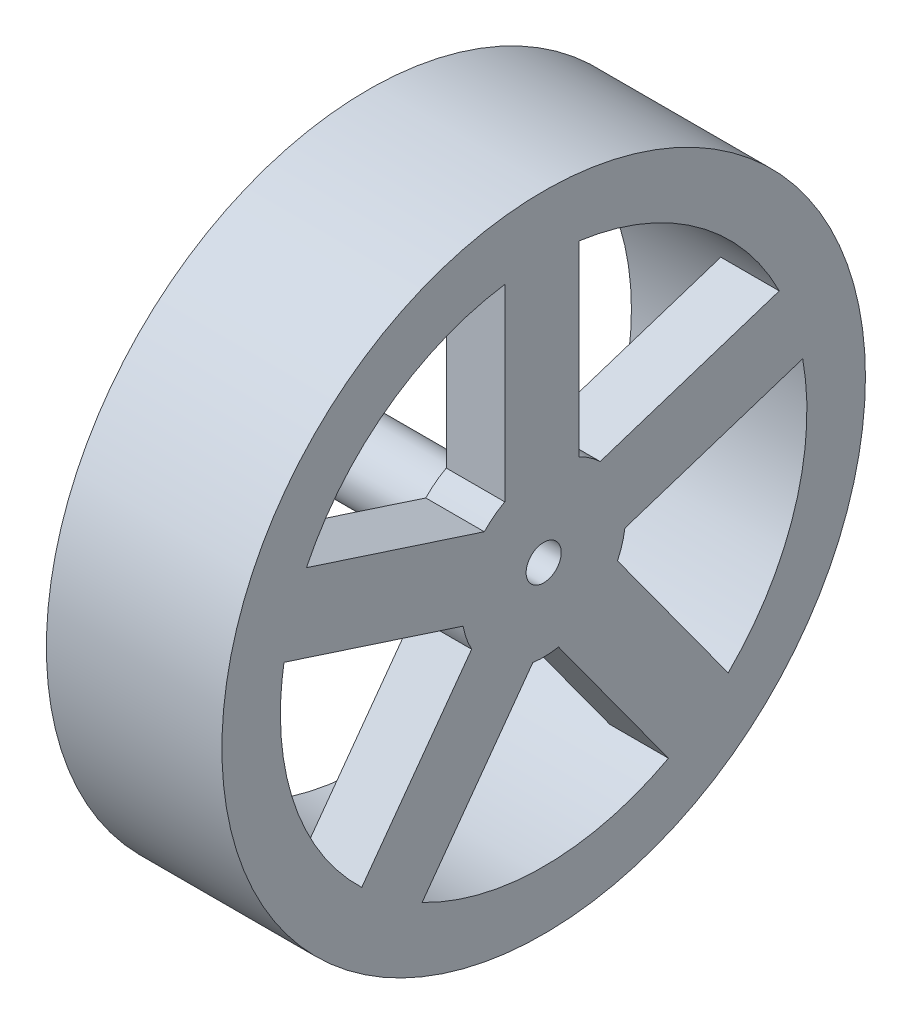
ISO-10303-21;
HEADER;
FILE_DESCRIPTION(('STEP AP214'),'2;1');
FILE_NAME('part.step','',(''),(''),'','','');
FILE_SCHEMA(('AUTOMOTIVE_DESIGN { 1 0 10303 214 1 1 1 1 }'));
ENDSEC;
DATA;
#1=APPLICATION_CONTEXT('core data for automotive mechanical design processes');
#2=APPLICATION_PROTOCOL_DEFINITION('international standard','automotive_design',2000,#1);
#3=PRODUCT_CONTEXT('',#1,'mechanical');
#4=PRODUCT('Part','Part','',(#3));
#5=PRODUCT_RELATED_PRODUCT_CATEGORY('part','',(#4));
#6=PRODUCT_DEFINITION_FORMATION('','',#4);
#7=PRODUCT_DEFINITION_CONTEXT('part definition',#1,'design');
#8=PRODUCT_DEFINITION('design','',#6,#7);
#9=PRODUCT_DEFINITION_SHAPE('','',#8);
#10=(LENGTH_UNIT() NAMED_UNIT(*) SI_UNIT(.MILLI.,.METRE.));
#11=(NAMED_UNIT(*) PLANE_ANGLE_UNIT() SI_UNIT($,.RADIAN.));
#12=(NAMED_UNIT(*) SI_UNIT($,.STERADIAN.) SOLID_ANGLE_UNIT());
#13=UNCERTAINTY_MEASURE_WITH_UNIT(LENGTH_MEASURE(1.E-05),#10,'distance_accuracy_value','');
#14=(GEOMETRIC_REPRESENTATION_CONTEXT(3) GLOBAL_UNCERTAINTY_ASSIGNED_CONTEXT((#13)) GLOBAL_UNIT_ASSIGNED_CONTEXT((#10,
#11,#12)) REPRESENTATION_CONTEXT('',''));
#15=CARTESIAN_POINT('',(0.,0.,0.));
#16=DIRECTION('',(0.,0.,1.));
#17=DIRECTION('',(1.,0.,0.));
#18=AXIS2_PLACEMENT_3D('',#15,#16,#17);
#19=CARTESIAN_POINT('',(10.,0.,0.));
#20=DIRECTION('',(-1.,0.,0.));
#21=DIRECTION('',(0.,0.,1.));
#22=AXIS2_PLACEMENT_3D('',#19,#20,#21);
#23=PLANE('',#22);
#24=CARTESIAN_POINT('',(10.,0.,0.));
#25=DIRECTION('',(-1.,0.,0.));
#26=DIRECTION('',(0.,0.,1.));
#27=AXIS2_PLACEMENT_3D('',#24,#25,#26);
#28=CIRCLE('',#27,3.);
#29=CARTESIAN_POINT('',(10.,0.,3.));
#30=VERTEX_POINT('',#29);
#31=EDGE_CURVE('E378',#30,#30,#28,.T.);
#32=ORIENTED_EDGE('',*,*,#31,.F.);
#33=EDGE_LOOP('',(#32));
#34=FACE_BOUND('',#33,.T.);
#35=CARTESIAN_POINT('',(10.,0.,0.));
#36=DIRECTION('',(-1.,0.,0.));
#37=DIRECTION('',(0.,0.,1.));
#38=AXIS2_PLACEMENT_3D('',#35,#36,#37);
#39=CIRCLE('',#38,22.5);
#40=CARTESIAN_POINT('',(10.,22.2529577585896,3.32503699143735));
#41=VERTEX_POINT('',#40);
#42=CARTESIAN_POINT('',(10.,22.2966726311427,-3.01801086473395));
#43=VERTEX_POINT('',#42);
#44=EDGE_CURVE('E386',#41,#43,#39,.T.);
#45=ORIENTED_EDGE('',*,*,#44,.T.);
#46=DIRECTION('',(0.,-1.,0.));
#47=VECTOR('',#46,1.);
#48=CARTESIAN_POINT('',(10.,0.,-3.01801086473395));
#49=LINE('',#48,#47);
#50=CARTESIAN_POINT('',(10.,6.31598055889565,-3.01801086473395));
#51=VERTEX_POINT('',#50);
#52=EDGE_CURVE('E308',#43,#51,#49,.T.);
#53=ORIENTED_EDGE('',*,*,#52,.T.);
#54=CARTESIAN_POINT('',(10.,0.,0.));
#55=DIRECTION('',(-1.,0.,0.));
#56=DIRECTION('',(0.,0.,1.));
#57=AXIS2_PLACEMENT_3D('',#54,#55,#56);
#58=CIRCLE('',#57,7.);
#59=CARTESIAN_POINT('',(10.,5.06580588633209,-4.83090164689748));
#60=VERTEX_POINT('',#59);
#61=EDGE_CURVE('E305',#51,#60,#58,.T.);
#62=ORIENTED_EDGE('',*,*,#61,.T.);
#63=DIRECTION('',(0.,0.309016994374948,-0.951056516295154));
#64=VECTOR('',#63,1.);
#65=CARTESIAN_POINT('',(10.,3.16229809762882,1.02749293727945));
#66=LINE('',#65,#64);
#67=CARTESIAN_POINT('',(10.,10.0388402201409,-20.136327545868));
#68=VERTEX_POINT('',#67);
#69=EDGE_CURVE('E297',#60,#68,#66,.T.);
#70=ORIENTED_EDGE('',*,*,#69,.T.);
#71=CARTESIAN_POINT('',(10.,4.01975186188303,-22.1380124439591));
#72=VERTEX_POINT('',#71);
#73=EDGE_CURVE('E658',#68,#72,#39,.T.);
#74=ORIENTED_EDGE('',*,*,#73,.T.);
#75=DIRECTION('',(0.,-0.309016994374941,0.951056516295156));
#76=VECTOR('',#75,1.);
#77=CARTESIAN_POINT('',(10.,-2.87029889915469,-0.932616646410966));
#78=LINE('',#77,#76);
#79=CARTESIAN_POINT('',(10.,-0.918553570314183,-6.93947111374225));
#80=VERTEX_POINT('',#79);
#81=EDGE_CURVE('E336',#72,#80,#78,.T.);
#82=ORIENTED_EDGE('',*,*,#81,.T.);
#83=CARTESIAN_POINT('',(10.,0.,0.));
#84=DIRECTION('',(-1.,0.,0.));
#85=DIRECTION('',(0.,0.,1.));
#86=AXIS2_PLACEMENT_3D('',#83,#84,#85);
#87=CIRCLE('',#86,7.);
#88=CARTESIAN_POINT('',(10.,-3.02904038178182,-6.31069840552734));
#89=VERTEX_POINT('',#88);
#90=EDGE_CURVE('E289',#80,#89,#87,.T.);
#91=ORIENTED_EDGE('',*,*,#90,.T.);
#92=DIRECTION('',(0.,-0.809016994374948,-0.587785252292473));
#93=VECTOR('',#92,1.);
#94=CARTESIAN_POINT('',(10.,1.95440770689347,-2.6900114329977));
#95=LINE('',#94,#93);
#96=CARTESIAN_POINT('',(10.,-16.0486132949134,-15.7699718233841));
#97=VERTEX_POINT('',#96);
#98=EDGE_CURVE('E326',#89,#97,#95,.T.);
#99=ORIENTED_EDGE('',*,*,#98,.T.);
#100=CARTESIAN_POINT('',(10.,-19.8123293541585,-10.6640332690004));
#101=VERTEX_POINT('',#100);
#102=EDGE_CURVE('E660',#97,#101,#39,.T.);
#103=ORIENTED_EDGE('',*,*,#102,.T.);
#104=DIRECTION('',(0.,0.809016994374948,0.587785252292473));
#105=VECTOR('',#104,1.);
#106=CARTESIAN_POINT('',(10.,-1.77394227754939,2.44162207877844));
#107=LINE('',#106,#105);
#108=CARTESIAN_POINT('',(10.,-6.88367788583734,-1.2708181475061));
#109=VERTEX_POINT('',#108);
#110=EDGE_CURVE('E282',#101,#109,#107,.T.);
#111=ORIENTED_EDGE('',*,*,#110,.T.);
#112=CARTESIAN_POINT('',(10.,0.,0.));
#113=DIRECTION('',(-1.,0.,0.));
#114=DIRECTION('',(0.,0.,1.));
#115=AXIS2_PLACEMENT_3D('',#112,#113,#114);
#116=CIRCLE('',#115,7.);
#117=CARTESIAN_POINT('',(10.,-6.93785579556901,0.930675539532332));
#118=VERTEX_POINT('',#117);
#119=EDGE_CURVE('E265',#109,#118,#116,.T.);
#120=ORIENTED_EDGE('',*,*,#119,.T.);
#121=DIRECTION('',(0.,-0.809016994374948,0.587785252292473));
#122=VECTOR('',#121,1.);
#123=CARTESIAN_POINT('',(10.,-1.95440770689337,-2.69001143299755));
#124=LINE('',#123,#122);
#125=CARTESIAN_POINT('',(10.,-19.9574287087003,10.3899489573889));
#126=VERTEX_POINT('',#125);
#127=EDGE_CURVE('E272',#118,#126,#124,.T.);
#128=ORIENTED_EDGE('',*,*,#127,.T.);
#129=CARTESIAN_POINT('',(10.,-16.2644447990596,15.5472774265574));
#130=VERTEX_POINT('',#129);
#131=EDGE_CURVE('E387',#126,#130,#39,.T.);
#132=ORIENTED_EDGE('',*,*,#131,.T.);
#133=DIRECTION('',(0.,0.809016994374947,-0.587785252292473));
#134=VECTOR('',#133,1.);
#135=CARTESIAN_POINT('',(10.,1.77394227754951,2.4416220787786));
#136=LINE('',#135,#134);
#137=CARTESIAN_POINT('',(10.,-3.33579333073878,6.15406230506338));
#138=VERTEX_POINT('',#137);
#139=EDGE_CURVE('E256',#130,#138,#136,.T.);
#140=ORIENTED_EDGE('',*,*,#139,.T.);
#141=CARTESIAN_POINT('',(10.,0.,0.));
#142=DIRECTION('',(-1.,0.,0.));
#143=DIRECTION('',(0.,0.,1.));
#144=AXIS2_PLACEMENT_3D('',#141,#142,#143);
#145=CIRCLE('',#144,7.);
#146=CARTESIAN_POINT('',(10.,-1.25879030892506,6.88588752145697));
#147=VERTEX_POINT('',#146);
#148=EDGE_CURVE('E246',#138,#147,#145,.T.);
#149=ORIENTED_EDGE('',*,*,#148,.T.);
#150=DIRECTION('',(0.,0.309016994374947,0.951056516295154));
#151=VECTOR('',#150,1.);
#152=CARTESIAN_POINT('',(10.,-3.16229809762855,1.02749293727936));
#153=LINE('',#152,#151);
#154=CARTESIAN_POINT('',(10.,3.7142440248835,22.1913134204269));
#155=VERTEX_POINT('',#154);
#156=EDGE_CURVE('E253',#147,#155,#153,.T.);
#157=ORIENTED_EDGE('',*,*,#156,.T.);
#158=CARTESIAN_POINT('',(10.,9.7603496601929,20.2727791511369));
#159=VERTEX_POINT('',#158);
#160=EDGE_CURVE('E382',#155,#159,#39,.T.);
#161=ORIENTED_EDGE('',*,*,#160,.T.);
#162=DIRECTION('',(0.,-0.309016994374964,-0.951056516295148));
#163=VECTOR('',#162,1.);
#164=CARTESIAN_POINT('',(10.,2.87029889915466,-0.932616646411031));
#165=LINE('',#164,#163);
#166=CARTESIAN_POINT('',(10.,4.82204422799531,5.07423782092021));
#167=VERTEX_POINT('',#166);
#168=EDGE_CURVE('E359',#159,#167,#165,.T.);
#169=ORIENTED_EDGE('',*,*,#168,.T.);
#170=CARTESIAN_POINT('',(10.,0.,0.));
#171=DIRECTION('',(-1.,0.,0.));
#172=DIRECTION('',(0.,0.,1.));
#173=AXIS2_PLACEMENT_3D('',#170,#171,#172);
#174=CIRCLE('',#173,7.);
#175=CARTESIAN_POINT('',(10.,6.15988059994455,3.32503699143735));
#176=VERTEX_POINT('',#175);
#177=EDGE_CURVE('E317',#167,#176,#174,.T.);
#178=ORIENTED_EDGE('',*,*,#177,.T.);
#179=DIRECTION('',(0.,1.,0.));
#180=VECTOR('',#179,1.);
#181=CARTESIAN_POINT('',(10.,0.,3.32503699143735));
#182=LINE('',#181,#180);
#183=EDGE_CURVE('E349',#176,#41,#182,.T.);
#184=ORIENTED_EDGE('',*,*,#183,.T.);
#185=EDGE_LOOP('',(#45,#53,#62,#70,#74,#82,#91,#99,#103,#111,#120,#128,#132,#140,#149,#157,#161,
#169,#178,#184));
#186=FACE_BOUND('',#185,.T.);
#187=ADVANCED_FACE('F91',(#34,#186),#23,.T.);
#188=CARTESIAN_POINT('',(15.,0.,0.));
#189=DIRECTION('',(1.,0.,0.));
#190=DIRECTION('',(0.,0.,-1.));
#191=AXIS2_PLACEMENT_3D('',#188,#189,#190);
#192=PLANE('',#191);
#193=CARTESIAN_POINT('',(15.,0.,0.));
#194=DIRECTION('',(1.,0.,0.));
#195=DIRECTION('',(0.,0.,-1.));
#196=AXIS2_PLACEMENT_3D('',#193,#194,#195);
#197=CIRCLE('',#196,1.5);
#198=CARTESIAN_POINT('',(15.,0.,-1.5));
#199=VERTEX_POINT('',#198);
#200=EDGE_CURVE('E385',#199,#199,#197,.T.);
#201=ORIENTED_EDGE('',*,*,#200,.F.);
#202=EDGE_LOOP('',(#201));
#203=FACE_BOUND('',#202,.T.);
#204=CARTESIAN_POINT('',(15.,0.,0.));
#205=DIRECTION('',(1.,0.,0.));
#206=DIRECTION('',(0.,0.,-1.));
#207=AXIS2_PLACEMENT_3D('',#204,#205,#206);
#208=CIRCLE('',#207,27.5);
#209=CARTESIAN_POINT('',(15.,0.,-27.5));
#210=VERTEX_POINT('',#209);
#211=EDGE_CURVE('E12',#210,#210,#208,.T.);
#212=ORIENTED_EDGE('',*,*,#211,.T.);
#213=EDGE_LOOP('',(#212));
#214=FACE_BOUND('',#213,.T.);
#215=DIRECTION('',(0.,1.,0.));
#216=VECTOR('',#215,1.);
#217=CARTESIAN_POINT('',(15.,0.,3.32503699143735));
#218=LINE('',#217,#216);
#219=CARTESIAN_POINT('',(15.,6.15988059994455,3.32503699143735));
#220=VERTEX_POINT('',#219);
#221=CARTESIAN_POINT('',(15.,22.2529577585896,3.32503699143735));
#222=VERTEX_POINT('',#221);
#223=EDGE_CURVE('E354',#220,#222,#218,.T.);
#224=ORIENTED_EDGE('',*,*,#223,.F.);
#225=CARTESIAN_POINT('',(15.,0.,0.));
#226=DIRECTION('',(-1.,0.,0.));
#227=DIRECTION('',(0.,0.,1.));
#228=AXIS2_PLACEMENT_3D('',#225,#226,#227);
#229=CIRCLE('',#228,7.);
#230=CARTESIAN_POINT('',(15.,4.82204422799531,5.07423782092021));
#231=VERTEX_POINT('',#230);
#232=EDGE_CURVE('E346',#231,#220,#229,.T.);
#233=ORIENTED_EDGE('',*,*,#232,.F.);
#234=DIRECTION('',(0.,-0.309016994374964,-0.951056516295148));
#235=VECTOR('',#234,1.);
#236=CARTESIAN_POINT('',(15.,2.87029889915466,-0.932616646411031));
#237=LINE('',#236,#235);
#238=CARTESIAN_POINT('',(15.,9.7603496601929,20.2727791511369));
#239=VERTEX_POINT('',#238);
#240=EDGE_CURVE('E348',#239,#231,#237,.T.);
#241=ORIENTED_EDGE('',*,*,#240,.F.);
#242=CARTESIAN_POINT('',(15.,0.,0.));
#243=DIRECTION('',(-1.,0.,0.));
#244=DIRECTION('',(0.,0.,1.));
#245=AXIS2_PLACEMENT_3D('',#242,#243,#244);
#246=CIRCLE('',#245,22.5);
#247=EDGE_CURVE('E351',#239,#222,#246,.T.);
#248=ORIENTED_EDGE('',*,*,#247,.T.);
#249=EDGE_LOOP('',(#224,#233,#241,#248));
#250=FACE_BOUND('',#249,.T.);
#251=DIRECTION('',(0.,-0.809016994374948,0.587785252292473));
#252=VECTOR('',#251,1.);
#253=CARTESIAN_POINT('',(15.,-1.95440770689337,-2.69001143299755));
#254=LINE('',#253,#252);
#255=CARTESIAN_POINT('',(15.,-6.93785579556901,0.930675539532332));
#256=VERTEX_POINT('',#255);
#257=CARTESIAN_POINT('',(15.,-19.9574287087003,10.3899489573889));
#258=VERTEX_POINT('',#257);
#259=EDGE_CURVE('E277',#256,#258,#254,.T.);
#260=ORIENTED_EDGE('',*,*,#259,.F.);
#261=CARTESIAN_POINT('',(15.,0.,0.));
#262=DIRECTION('',(-1.,0.,0.));
#263=DIRECTION('',(0.,0.,1.));
#264=AXIS2_PLACEMENT_3D('',#261,#262,#263);
#265=CIRCLE('',#264,7.);
#266=CARTESIAN_POINT('',(15.,-6.88367788583734,-1.2708181475061));
#267=VERTEX_POINT('',#266);
#268=EDGE_CURVE('E269',#267,#256,#265,.T.);
#269=ORIENTED_EDGE('',*,*,#268,.F.);
#270=DIRECTION('',(0.,0.809016994374948,0.587785252292473));
#271=VECTOR('',#270,1.);
#272=CARTESIAN_POINT('',(15.,-1.77394227754939,2.44162207877844));
#273=LINE('',#272,#271);
#274=CARTESIAN_POINT('',(15.,-19.8123293541586,-10.6640332690004));
#275=VERTEX_POINT('',#274);
#276=EDGE_CURVE('E271',#275,#267,#273,.T.);
#277=ORIENTED_EDGE('',*,*,#276,.F.);
#278=CARTESIAN_POINT('',(15.,0.,0.));
#279=DIRECTION('',(-1.,0.,0.));
#280=DIRECTION('',(0.,0.,1.));
#281=AXIS2_PLACEMENT_3D('',#278,#279,#280);
#282=CIRCLE('',#281,22.5);
#283=EDGE_CURVE('E274',#275,#258,#282,.T.);
#284=ORIENTED_EDGE('',*,*,#283,.T.);
#285=EDGE_LOOP('',(#260,#269,#277,#284));
#286=FACE_BOUND('',#285,.T.);
#287=DIRECTION('',(0.,0.309016994374947,0.951056516295154));
#288=VECTOR('',#287,1.);
#289=CARTESIAN_POINT('',(15.,-3.16229809762855,1.02749293727936));
#290=LINE('',#289,#288);
#291=CARTESIAN_POINT('',(15.,-1.25879030892506,6.88588752145697));
#292=VERTEX_POINT('',#291);
#293=CARTESIAN_POINT('',(15.,3.7142440248835,22.1913134204269));
#294=VERTEX_POINT('',#293);
#295=EDGE_CURVE('E248',#292,#294,#290,.T.);
#296=ORIENTED_EDGE('',*,*,#295,.F.);
#297=CARTESIAN_POINT('',(15.,0.,0.));
#298=DIRECTION('',(-1.,0.,0.));
#299=DIRECTION('',(0.,0.,1.));
#300=AXIS2_PLACEMENT_3D('',#297,#298,#299);
#301=CIRCLE('',#300,7.);
#302=CARTESIAN_POINT('',(15.,-3.33579333073878,6.15406230506338));
#303=VERTEX_POINT('',#302);
#304=EDGE_CURVE('E239',#303,#292,#301,.T.);
#305=ORIENTED_EDGE('',*,*,#304,.F.);
#306=DIRECTION('',(0.,0.809016994374947,-0.587785252292473));
#307=VECTOR('',#306,1.);
#308=CARTESIAN_POINT('',(15.,1.77394227754951,2.4416220787786));
#309=LINE('',#308,#307);
#310=CARTESIAN_POINT('',(15.,-16.2644447990596,15.5472774265574));
#311=VERTEX_POINT('',#310);
#312=EDGE_CURVE('E228',#311,#303,#309,.T.);
#313=ORIENTED_EDGE('',*,*,#312,.F.);
#314=CARTESIAN_POINT('',(15.,0.,0.));
#315=DIRECTION('',(-1.,0.,0.));
#316=DIRECTION('',(0.,0.,1.));
#317=AXIS2_PLACEMENT_3D('',#314,#315,#316);
#318=CIRCLE('',#317,22.5);
#319=EDGE_CURVE('E238',#311,#294,#318,.T.);
#320=ORIENTED_EDGE('',*,*,#319,.T.);
#321=EDGE_LOOP('',(#296,#305,#313,#320));
#322=FACE_BOUND('',#321,.T.);
#323=DIRECTION('',(0.,-0.809016994374948,-0.587785252292473));
#324=VECTOR('',#323,1.);
#325=CARTESIAN_POINT('',(15.,1.95440770689347,-2.6900114329977));
#326=LINE('',#325,#324);
#327=CARTESIAN_POINT('',(15.,-3.02904038178182,-6.31069840552734));
#328=VERTEX_POINT('',#327);
#329=CARTESIAN_POINT('',(15.,-16.0486132949134,-15.7699718233841));
#330=VERTEX_POINT('',#329);
#331=EDGE_CURVE('E331',#328,#330,#326,.T.);
#332=ORIENTED_EDGE('',*,*,#331,.F.);
#333=CARTESIAN_POINT('',(15.,0.,0.));
#334=DIRECTION('',(-1.,0.,0.));
#335=DIRECTION('',(0.,0.,1.));
#336=AXIS2_PLACEMENT_3D('',#333,#334,#335);
#337=CIRCLE('',#336,7.);
#338=CARTESIAN_POINT('',(15.,-0.918553570314183,-6.93947111374225));
#339=VERTEX_POINT('',#338);
#340=EDGE_CURVE('E323',#339,#328,#337,.T.);
#341=ORIENTED_EDGE('',*,*,#340,.F.);
#342=DIRECTION('',(0.,-0.309016994374941,0.951056516295156));
#343=VECTOR('',#342,1.);
#344=CARTESIAN_POINT('',(15.,-2.87029889915469,-0.932616646410966));
#345=LINE('',#344,#343);
#346=CARTESIAN_POINT('',(15.,4.01975186188303,-22.1380124439591));
#347=VERTEX_POINT('',#346);
#348=EDGE_CURVE('E325',#347,#339,#345,.T.);
#349=ORIENTED_EDGE('',*,*,#348,.F.);
#350=CARTESIAN_POINT('',(15.,0.,0.));
#351=DIRECTION('',(-1.,0.,0.));
#352=DIRECTION('',(0.,0.,1.));
#353=AXIS2_PLACEMENT_3D('',#350,#351,#352);
#354=CIRCLE('',#353,22.5);
#355=EDGE_CURVE('E328',#347,#330,#354,.T.);
#356=ORIENTED_EDGE('',*,*,#355,.T.);
#357=EDGE_LOOP('',(#332,#341,#349,#356));
#358=FACE_BOUND('',#357,.T.);
#359=DIRECTION('',(0.,0.309016994374948,-0.951056516295154));
#360=VECTOR('',#359,1.);
#361=CARTESIAN_POINT('',(15.,3.16229809762882,1.02749293727945));
#362=LINE('',#361,#360);
#363=CARTESIAN_POINT('',(15.,5.06580588633209,-4.83090164689748));
#364=VERTEX_POINT('',#363);
#365=CARTESIAN_POINT('',(15.,10.0388402201409,-20.136327545868));
#366=VERTEX_POINT('',#365);
#367=EDGE_CURVE('E302',#364,#366,#362,.T.);
#368=ORIENTED_EDGE('',*,*,#367,.F.);
#369=CARTESIAN_POINT('',(15.,0.,0.));
#370=DIRECTION('',(-1.,0.,0.));
#371=DIRECTION('',(0.,0.,1.));
#372=AXIS2_PLACEMENT_3D('',#369,#370,#371);
#373=CIRCLE('',#372,7.);
#374=CARTESIAN_POINT('',(15.,6.31598055889565,-3.01801086473395));
#375=VERTEX_POINT('',#374);
#376=EDGE_CURVE('E294',#375,#364,#373,.T.);
#377=ORIENTED_EDGE('',*,*,#376,.F.);
#378=DIRECTION('',(0.,-1.,0.));
#379=VECTOR('',#378,1.);
#380=CARTESIAN_POINT('',(15.,0.,-3.01801086473395));
#381=LINE('',#380,#379);
#382=CARTESIAN_POINT('',(15.,22.2966726311427,-3.01801086473395));
#383=VERTEX_POINT('',#382);
#384=EDGE_CURVE('E296',#383,#375,#381,.T.);
#385=ORIENTED_EDGE('',*,*,#384,.F.);
#386=CARTESIAN_POINT('',(15.,0.,0.));
#387=DIRECTION('',(-1.,0.,0.));
#388=DIRECTION('',(0.,0.,1.));
#389=AXIS2_PLACEMENT_3D('',#386,#387,#388);
#390=CIRCLE('',#389,22.5);
#391=EDGE_CURVE('E299',#383,#366,#390,.T.);
#392=ORIENTED_EDGE('',*,*,#391,.T.);
#393=EDGE_LOOP('',(#368,#377,#385,#392));
#394=FACE_BOUND('',#393,.T.);
#395=ADVANCED_FACE('F251',(#203,#214,#250,#286,#322,#358,#394),#192,.T.);
#396=CARTESIAN_POINT('',(15.,0.,0.));
#397=DIRECTION('',(-1.,0.,0.));
#398=DIRECTION('',(0.,0.,1.));
#399=AXIS2_PLACEMENT_3D('',#396,#397,#398);
#400=CYLINDRICAL_SURFACE('',#399,27.5);
#401=ORIENTED_EDGE('',*,*,#211,.F.);
#402=EDGE_LOOP('',(#401));
#403=FACE_BOUND('',#402,.T.);
#404=CARTESIAN_POINT('',(0.,0.,0.));
#405=DIRECTION('',(1.,0.,0.));
#406=DIRECTION('',(0.,0.,-1.));
#407=AXIS2_PLACEMENT_3D('',#404,#405,#406);
#408=CIRCLE('',#407,27.5);
#409=CARTESIAN_POINT('',(0.,0.,-27.5));
#410=VERTEX_POINT('',#409);
#411=EDGE_CURVE('E95',#410,#410,#408,.T.);
#412=ORIENTED_EDGE('',*,*,#411,.T.);
#413=EDGE_LOOP('',(#412));
#414=FACE_BOUND('',#413,.T.);
#415=ADVANCED_FACE('F93',(#403,#414),#400,.T.);
#416=CARTESIAN_POINT('',(0.,0.,0.));
#417=DIRECTION('',(1.,0.,0.));
#418=DIRECTION('',(0.,0.,-1.));
#419=AXIS2_PLACEMENT_3D('',#416,#417,#418);
#420=PLANE('',#419);
#421=CARTESIAN_POINT('',(0.,0.,0.));
#422=DIRECTION('',(-1.,0.,0.));
#423=DIRECTION('',(0.,0.,1.));
#424=AXIS2_PLACEMENT_3D('',#421,#422,#423);
#425=CIRCLE('',#424,22.5);
#426=CARTESIAN_POINT('',(0.,0.,22.5));
#427=VERTEX_POINT('',#426);
#428=EDGE_CURVE('E381',#427,#427,#425,.T.);
#429=ORIENTED_EDGE('',*,*,#428,.F.);
#430=EDGE_LOOP('',(#429));
#431=FACE_BOUND('',#430,.T.);
#432=ORIENTED_EDGE('',*,*,#411,.F.);
#433=EDGE_LOOP('',(#432));
#434=FACE_BOUND('',#433,.T.);
#435=ADVANCED_FACE('F397',(#431,#434),#420,.F.);
#436=CARTESIAN_POINT('',(0.,0.,0.));
#437=DIRECTION('',(1.,0.,0.));
#438=DIRECTION('',(0.,0.,-1.));
#439=AXIS2_PLACEMENT_3D('',#436,#437,#438);
#440=CYLINDRICAL_SURFACE('',#439,1.5);
#441=ORIENTED_EDGE('',*,*,#200,.T.);
#442=EDGE_LOOP('',(#441));
#443=FACE_BOUND('',#442,.T.);
#444=CARTESIAN_POINT('',(-3.,0.,0.));
#445=DIRECTION('',(-1.,0.,0.));
#446=DIRECTION('',(0.,0.,1.));
#447=AXIS2_PLACEMENT_3D('',#444,#445,#446);
#448=CIRCLE('',#447,1.5);
#449=CARTESIAN_POINT('',(-3.,0.,1.5));
#450=VERTEX_POINT('',#449);
#451=EDGE_CURVE('E367',#450,#450,#448,.T.);
#452=ORIENTED_EDGE('',*,*,#451,.T.);
#453=EDGE_LOOP('',(#452));
#454=FACE_BOUND('',#453,.T.);
#455=ADVANCED_FACE('F399',(#443,#454),#440,.F.);
#456=CARTESIAN_POINT('',(10.,0.,0.));
#457=DIRECTION('',(-1.,0.,0.));
#458=DIRECTION('',(0.,0.,1.));
#459=AXIS2_PLACEMENT_3D('',#456,#457,#458);
#460=CYLINDRICAL_SURFACE('',#459,22.5);
#461=ORIENTED_EDGE('',*,*,#160,.F.);
#462=DIRECTION('',(-1.,0.,0.));
#463=VECTOR('',#462,1.);
#464=CARTESIAN_POINT('',(15.,3.7142440248835,22.1913134204269));
#465=LINE('',#464,#463);
#466=EDGE_CURVE('E266',#294,#155,#465,.T.);
#467=ORIENTED_EDGE('',*,*,#466,.F.);
#468=ORIENTED_EDGE('',*,*,#319,.F.);
#469=DIRECTION('',(-1.,0.,0.));
#470=VECTOR('',#469,1.);
#471=CARTESIAN_POINT('',(15.,-16.2644447990596,15.5472774265574));
#472=LINE('',#471,#470);
#473=EDGE_CURVE('E234',#311,#130,#472,.T.);
#474=ORIENTED_EDGE('',*,*,#473,.T.);
#475=ORIENTED_EDGE('',*,*,#131,.F.);
#476=DIRECTION('',(-1.,0.,0.));
#477=VECTOR('',#476,1.);
#478=CARTESIAN_POINT('',(15.,-19.9574287087003,10.3899489573889));
#479=LINE('',#478,#477);
#480=EDGE_CURVE('E106',#258,#126,#479,.T.);
#481=ORIENTED_EDGE('',*,*,#480,.F.);
#482=ORIENTED_EDGE('',*,*,#283,.F.);
#483=DIRECTION('',(-1.,0.,0.));
#484=VECTOR('',#483,1.);
#485=CARTESIAN_POINT('',(15.,-19.8123293541585,-10.6640332690004));
#486=LINE('',#485,#484);
#487=EDGE_CURVE('E291',#275,#101,#486,.T.);
#488=ORIENTED_EDGE('',*,*,#487,.T.);
#489=ORIENTED_EDGE('',*,*,#102,.F.);
#490=DIRECTION('',(-1.,0.,0.));
#491=VECTOR('',#490,1.);
#492=CARTESIAN_POINT('',(15.,-16.0486132949134,-15.7699718233841));
#493=LINE('',#492,#491);
#494=EDGE_CURVE('E114',#330,#97,#493,.T.);
#495=ORIENTED_EDGE('',*,*,#494,.F.);
#496=ORIENTED_EDGE('',*,*,#355,.F.);
#497=DIRECTION('',(-1.,0.,0.));
#498=VECTOR('',#497,1.);
#499=CARTESIAN_POINT('',(15.,4.01975186188303,-22.1380124439591));
#500=LINE('',#499,#498);
#501=EDGE_CURVE('E343',#347,#72,#500,.T.);
#502=ORIENTED_EDGE('',*,*,#501,.T.);
#503=ORIENTED_EDGE('',*,*,#73,.F.);
#504=DIRECTION('',(-1.,0.,0.));
#505=VECTOR('',#504,1.);
#506=CARTESIAN_POINT('',(15.,10.0388402201409,-20.136327545868));
#507=LINE('',#506,#505);
#508=EDGE_CURVE('E318',#366,#68,#507,.T.);
#509=ORIENTED_EDGE('',*,*,#508,.F.);
#510=ORIENTED_EDGE('',*,*,#391,.F.);
#511=DIRECTION('',(-1.,0.,0.));
#512=VECTOR('',#511,1.);
#513=CARTESIAN_POINT('',(15.,22.2966726311427,-3.01801086473395));
#514=LINE('',#513,#512);
#515=EDGE_CURVE('E320',#383,#43,#514,.T.);
#516=ORIENTED_EDGE('',*,*,#515,.T.);
#517=ORIENTED_EDGE('',*,*,#44,.F.);
#518=DIRECTION('',(-1.,0.,0.));
#519=VECTOR('',#518,1.);
#520=CARTESIAN_POINT('',(15.,22.2529577585896,3.32503699143735));
#521=LINE('',#520,#519);
#522=EDGE_CURVE('E368',#222,#41,#521,.T.);
#523=ORIENTED_EDGE('',*,*,#522,.F.);
#524=ORIENTED_EDGE('',*,*,#247,.F.);
#525=DIRECTION('',(-1.,0.,0.));
#526=VECTOR('',#525,1.);
#527=CARTESIAN_POINT('',(15.,9.7603496601929,20.2727791511369));
#528=LINE('',#527,#526);
#529=EDGE_CURVE('E370',#239,#159,#528,.T.);
#530=ORIENTED_EDGE('',*,*,#529,.T.);
#531=EDGE_LOOP('',(#461,#467,#468,#474,#475,#481,#482,#488,#489,#495,#496,#502,#503,#509,#510,
#516,#517,#523,#524,#530));
#532=FACE_BOUND('',#531,.T.);
#533=ORIENTED_EDGE('',*,*,#428,.T.);
#534=EDGE_LOOP('',(#533));
#535=FACE_BOUND('',#534,.T.);
#536=ADVANCED_FACE('F405',(#532,#535),#460,.F.);
#537=CARTESIAN_POINT('',(10.,0.,0.));
#538=DIRECTION('',(-1.,0.,0.));
#539=DIRECTION('',(0.,0.,1.));
#540=AXIS2_PLACEMENT_3D('',#537,#538,#539);
#541=CYLINDRICAL_SURFACE('',#540,3.);
#542=ORIENTED_EDGE('',*,*,#31,.T.);
#543=EDGE_LOOP('',(#542));
#544=FACE_BOUND('',#543,.T.);
#545=CARTESIAN_POINT('',(-3.,0.,0.));
#546=DIRECTION('',(-1.,0.,0.));
#547=DIRECTION('',(0.,0.,1.));
#548=AXIS2_PLACEMENT_3D('',#545,#546,#547);
#549=CIRCLE('',#548,3.);
#550=CARTESIAN_POINT('',(-3.,0.,3.));
#551=VERTEX_POINT('',#550);
#552=EDGE_CURVE('E375',#551,#551,#549,.T.);
#553=ORIENTED_EDGE('',*,*,#552,.F.);
#554=EDGE_LOOP('',(#553));
#555=FACE_BOUND('',#554,.T.);
#556=ADVANCED_FACE('F422',(#544,#555),#541,.T.);
#557=CARTESIAN_POINT('',(-3.,0.,0.));
#558=DIRECTION('',(-1.,0.,0.));
#559=DIRECTION('',(0.,0.,1.));
#560=AXIS2_PLACEMENT_3D('',#557,#558,#559);
#561=PLANE('',#560);
#562=ORIENTED_EDGE('',*,*,#552,.T.);
#563=EDGE_LOOP('',(#562));
#564=FACE_BOUND('',#563,.T.);
#565=ORIENTED_EDGE('',*,*,#451,.F.);
#566=EDGE_LOOP('',(#565));
#567=FACE_BOUND('',#566,.T.);
#568=ADVANCED_FACE('F430',(#564,#567),#561,.T.);
#569=CARTESIAN_POINT('',(15.,0.,0.));
#570=DIRECTION('',(-1.,0.,0.));
#571=DIRECTION('',(0.,0.,1.));
#572=AXIS2_PLACEMENT_3D('',#569,#570,#571);
#573=CYLINDRICAL_SURFACE('',#572,7.);
#574=ORIENTED_EDGE('',*,*,#177,.F.);
#575=DIRECTION('',(-1.,0.,0.));
#576=VECTOR('',#575,1.);
#577=CARTESIAN_POINT('',(15.,4.82204422799531,5.07423782092021));
#578=LINE('',#577,#576);
#579=EDGE_CURVE('E356',#231,#167,#578,.T.);
#580=ORIENTED_EDGE('',*,*,#579,.F.);
#581=ORIENTED_EDGE('',*,*,#232,.T.);
#582=DIRECTION('',(-1.,0.,0.));
#583=VECTOR('',#582,1.);
#584=CARTESIAN_POINT('',(15.,6.15988059994455,3.32503699143735));
#585=LINE('',#584,#583);
#586=EDGE_CURVE('E364',#220,#176,#585,.T.);
#587=ORIENTED_EDGE('',*,*,#586,.T.);
#588=EDGE_LOOP('',(#574,#580,#581,#587));
#589=FACE_BOUND('',#588,.T.);
#590=ADVANCED_FACE('F487',(#589),#573,.T.);
#591=CARTESIAN_POINT('',(15.,0.,3.32503699143735));
#592=DIRECTION('',(0.,0.,1.));
#593=DIRECTION('',(0.,-1.,0.));
#594=AXIS2_PLACEMENT_3D('',#591,#592,#593);
#595=PLANE('',#594);
#596=ORIENTED_EDGE('',*,*,#183,.F.);
#597=ORIENTED_EDGE('',*,*,#586,.F.);
#598=ORIENTED_EDGE('',*,*,#223,.T.);
#599=ORIENTED_EDGE('',*,*,#522,.T.);
#600=EDGE_LOOP('',(#596,#597,#598,#599));
#601=FACE_BOUND('',#600,.T.);
#602=ADVANCED_FACE('F484',(#601),#595,.T.);
#603=CARTESIAN_POINT('',(15.,2.87029889915466,-0.932616646411031));
#604=DIRECTION('',(0.,0.951056516295148,-0.309016994374964));
#605=DIRECTION('',(0.,0.309016994374964,0.951056516295148));
#606=AXIS2_PLACEMENT_3D('',#603,#604,#605);
#607=PLANE('',#606);
#608=ORIENTED_EDGE('',*,*,#168,.F.);
#609=ORIENTED_EDGE('',*,*,#529,.F.);
#610=ORIENTED_EDGE('',*,*,#240,.T.);
#611=ORIENTED_EDGE('',*,*,#579,.T.);
#612=EDGE_LOOP('',(#608,#609,#610,#611));
#613=FACE_BOUND('',#612,.T.);
#614=ADVANCED_FACE('F460',(#613),#607,.T.);
#615=CARTESIAN_POINT('',(15.,0.,0.));
#616=DIRECTION('',(-1.,0.,0.));
#617=DIRECTION('',(0.,0.,1.));
#618=AXIS2_PLACEMENT_3D('',#615,#616,#617);
#619=CYLINDRICAL_SURFACE('',#618,7.);
#620=ORIENTED_EDGE('',*,*,#119,.F.);
#621=DIRECTION('',(-1.,0.,0.));
#622=VECTOR('',#621,1.);
#623=CARTESIAN_POINT('',(15.,-6.88367788583734,-1.2708181475061));
#624=LINE('',#623,#622);
#625=EDGE_CURVE('E279',#267,#109,#624,.T.);
#626=ORIENTED_EDGE('',*,*,#625,.F.);
#627=ORIENTED_EDGE('',*,*,#268,.T.);
#628=DIRECTION('',(-1.,0.,0.));
#629=VECTOR('',#628,1.);
#630=CARTESIAN_POINT('',(15.,-6.93785579556901,0.930675539532332));
#631=LINE('',#630,#629);
#632=EDGE_CURVE('E286',#256,#118,#631,.T.);
#633=ORIENTED_EDGE('',*,*,#632,.T.);
#634=EDGE_LOOP('',(#620,#626,#627,#633));
#635=FACE_BOUND('',#634,.T.);
#636=ADVANCED_FACE('F454',(#635),#619,.T.);
#637=CARTESIAN_POINT('',(15.,-1.95440770689337,-2.69001143299755));
#638=DIRECTION('',(0.,-0.587785252292473,-0.809016994374947));
#639=DIRECTION('',(0.,0.809016994374948,-0.587785252292473));
#640=AXIS2_PLACEMENT_3D('',#637,#638,#639);
#641=PLANE('',#640);
#642=ORIENTED_EDGE('',*,*,#127,.F.);
#643=ORIENTED_EDGE('',*,*,#632,.F.);
#644=ORIENTED_EDGE('',*,*,#259,.T.);
#645=ORIENTED_EDGE('',*,*,#480,.T.);
#646=EDGE_LOOP('',(#642,#643,#644,#645));
#647=FACE_BOUND('',#646,.T.);
#648=ADVANCED_FACE('F451',(#647),#641,.T.);
#649=CARTESIAN_POINT('',(15.,-1.77394227754939,2.44162207877844));
#650=DIRECTION('',(0.,-0.587785252292473,0.809016994374947));
#651=DIRECTION('',(0.,-0.809016994374948,-0.587785252292473));
#652=AXIS2_PLACEMENT_3D('',#649,#650,#651);
#653=PLANE('',#652);
#654=ORIENTED_EDGE('',*,*,#110,.F.);
#655=ORIENTED_EDGE('',*,*,#487,.F.);
#656=ORIENTED_EDGE('',*,*,#276,.T.);
#657=ORIENTED_EDGE('',*,*,#625,.T.);
#658=EDGE_LOOP('',(#654,#655,#656,#657));
#659=FACE_BOUND('',#658,.T.);
#660=ADVANCED_FACE('F448',(#659),#653,.T.);
#661=CARTESIAN_POINT('',(15.,0.,0.));
#662=DIRECTION('',(-1.,0.,0.));
#663=DIRECTION('',(0.,0.,1.));
#664=AXIS2_PLACEMENT_3D('',#661,#662,#663);
#665=CYLINDRICAL_SURFACE('',#664,7.);
#666=ORIENTED_EDGE('',*,*,#148,.F.);
#667=DIRECTION('',(-1.,0.,0.));
#668=VECTOR('',#667,1.);
#669=CARTESIAN_POINT('',(15.,-3.33579333073878,6.15406230506338));
#670=LINE('',#669,#668);
#671=EDGE_CURVE('E232',#303,#138,#670,.T.);
#672=ORIENTED_EDGE('',*,*,#671,.F.);
#673=ORIENTED_EDGE('',*,*,#304,.T.);
#674=DIRECTION('',(-1.,0.,0.));
#675=VECTOR('',#674,1.);
#676=CARTESIAN_POINT('',(15.,-1.25879030892506,6.88588752145697));
#677=LINE('',#676,#675);
#678=EDGE_CURVE('E263',#292,#147,#677,.T.);
#679=ORIENTED_EDGE('',*,*,#678,.T.);
#680=EDGE_LOOP('',(#666,#672,#673,#679));
#681=FACE_BOUND('',#680,.T.);
#682=ADVANCED_FACE('F242',(#681),#665,.T.);
#683=CARTESIAN_POINT('',(15.,-3.16229809762855,1.02749293727936));
#684=DIRECTION('',(0.,-0.951056516295154,0.309016994374947));
#685=DIRECTION('',(0.,-0.309016994374947,-0.951056516295154));
#686=AXIS2_PLACEMENT_3D('',#683,#684,#685);
#687=PLANE('',#686);
#688=ORIENTED_EDGE('',*,*,#156,.F.);
#689=ORIENTED_EDGE('',*,*,#678,.F.);
#690=ORIENTED_EDGE('',*,*,#295,.T.);
#691=ORIENTED_EDGE('',*,*,#466,.T.);
#692=EDGE_LOOP('',(#688,#689,#690,#691));
#693=FACE_BOUND('',#692,.T.);
#694=ADVANCED_FACE('F439',(#693),#687,.T.);
#695=CARTESIAN_POINT('',(15.,1.77394227754951,2.4416220787786));
#696=DIRECTION('',(0.,0.587785252292473,0.809016994374947));
#697=DIRECTION('',(0.,-0.809016994374947,0.587785252292473));
#698=AXIS2_PLACEMENT_3D('',#695,#696,#697);
#699=PLANE('',#698);
#700=ORIENTED_EDGE('',*,*,#139,.F.);
#701=ORIENTED_EDGE('',*,*,#473,.F.);
#702=ORIENTED_EDGE('',*,*,#312,.T.);
#703=ORIENTED_EDGE('',*,*,#671,.T.);
#704=EDGE_LOOP('',(#700,#701,#702,#703));
#705=FACE_BOUND('',#704,.T.);
#706=ADVANCED_FACE('F231',(#705),#699,.T.);
#707=CARTESIAN_POINT('',(15.,0.,0.));
#708=DIRECTION('',(-1.,0.,0.));
#709=DIRECTION('',(0.,0.,1.));
#710=AXIS2_PLACEMENT_3D('',#707,#708,#709);
#711=CYLINDRICAL_SURFACE('',#710,7.);
#712=ORIENTED_EDGE('',*,*,#90,.F.);
#713=DIRECTION('',(-1.,0.,0.));
#714=VECTOR('',#713,1.);
#715=CARTESIAN_POINT('',(15.,-0.918553570314183,-6.93947111374225));
#716=LINE('',#715,#714);
#717=EDGE_CURVE('E333',#339,#80,#716,.T.);
#718=ORIENTED_EDGE('',*,*,#717,.F.);
#719=ORIENTED_EDGE('',*,*,#340,.T.);
#720=DIRECTION('',(-1.,0.,0.));
#721=VECTOR('',#720,1.);
#722=CARTESIAN_POINT('',(15.,-3.02904038178182,-6.31069840552734));
#723=LINE('',#722,#721);
#724=EDGE_CURVE('E309',#328,#89,#723,.T.);
#725=ORIENTED_EDGE('',*,*,#724,.T.);
#726=EDGE_LOOP('',(#712,#718,#719,#725));
#727=FACE_BOUND('',#726,.T.);
#728=ADVANCED_FACE('F446',(#727),#711,.T.);
#729=CARTESIAN_POINT('',(15.,1.95440770689347,-2.6900114329977));
#730=DIRECTION('',(0.,0.587785252292473,-0.809016994374948));
#731=DIRECTION('',(0.,0.809016994374948,0.587785252292473));
#732=AXIS2_PLACEMENT_3D('',#729,#730,#731);
#733=PLANE('',#732);
#734=ORIENTED_EDGE('',*,*,#98,.F.);
#735=ORIENTED_EDGE('',*,*,#724,.F.);
#736=ORIENTED_EDGE('',*,*,#331,.T.);
#737=ORIENTED_EDGE('',*,*,#494,.T.);
#738=EDGE_LOOP('',(#734,#735,#736,#737));
#739=FACE_BOUND('',#738,.T.);
#740=ADVANCED_FACE('F475',(#739),#733,.T.);
#741=CARTESIAN_POINT('',(15.,-2.87029889915469,-0.932616646410966));
#742=DIRECTION('',(0.,-0.951056516295156,-0.309016994374941));
#743=DIRECTION('',(0.,0.309016994374941,-0.951056516295156));
#744=AXIS2_PLACEMENT_3D('',#741,#742,#743);
#745=PLANE('',#744);
#746=ORIENTED_EDGE('',*,*,#81,.F.);
#747=ORIENTED_EDGE('',*,*,#501,.F.);
#748=ORIENTED_EDGE('',*,*,#348,.T.);
#749=ORIENTED_EDGE('',*,*,#717,.T.);
#750=EDGE_LOOP('',(#746,#747,#748,#749));
#751=FACE_BOUND('',#750,.T.);
#752=ADVANCED_FACE('F473',(#751),#745,.T.);
#753=CARTESIAN_POINT('',(15.,0.,0.));
#754=DIRECTION('',(-1.,0.,0.));
#755=DIRECTION('',(0.,0.,1.));
#756=AXIS2_PLACEMENT_3D('',#753,#754,#755);
#757=CYLINDRICAL_SURFACE('',#756,7.);
#758=ORIENTED_EDGE('',*,*,#61,.F.);
#759=DIRECTION('',(-1.,0.,0.));
#760=VECTOR('',#759,1.);
#761=CARTESIAN_POINT('',(15.,6.31598055889565,-3.01801086473395));
#762=LINE('',#761,#760);
#763=EDGE_CURVE('E304',#375,#51,#762,.T.);
#764=ORIENTED_EDGE('',*,*,#763,.F.);
#765=ORIENTED_EDGE('',*,*,#376,.T.);
#766=DIRECTION('',(-1.,0.,0.));
#767=VECTOR('',#766,1.);
#768=CARTESIAN_POINT('',(15.,5.06580588633209,-4.83090164689748));
#769=LINE('',#768,#767);
#770=EDGE_CURVE('E314',#364,#60,#769,.T.);
#771=ORIENTED_EDGE('',*,*,#770,.T.);
#772=EDGE_LOOP('',(#758,#764,#765,#771));
#773=FACE_BOUND('',#772,.T.);
#774=ADVANCED_FACE('F466',(#773),#757,.T.);
#775=CARTESIAN_POINT('',(15.,3.16229809762882,1.02749293727945));
#776=DIRECTION('',(0.,0.951056516295153,0.309016994374948));
#777=DIRECTION('',(0.,-0.309016994374948,0.951056516295154));
#778=AXIS2_PLACEMENT_3D('',#775,#776,#777);
#779=PLANE('',#778);
#780=ORIENTED_EDGE('',*,*,#69,.F.);
#781=ORIENTED_EDGE('',*,*,#770,.F.);
#782=ORIENTED_EDGE('',*,*,#367,.T.);
#783=ORIENTED_EDGE('',*,*,#508,.T.);
#784=EDGE_LOOP('',(#780,#781,#782,#783));
#785=FACE_BOUND('',#784,.T.);
#786=ADVANCED_FACE('F462',(#785),#779,.T.);
#787=CARTESIAN_POINT('',(15.,0.,-3.01801086473395));
#788=DIRECTION('',(0.,0.,-1.));
#789=DIRECTION('',(0.,1.,0.));
#790=AXIS2_PLACEMENT_3D('',#787,#788,#789);
#791=PLANE('',#790);
#792=ORIENTED_EDGE('',*,*,#52,.F.);
#793=ORIENTED_EDGE('',*,*,#515,.F.);
#794=ORIENTED_EDGE('',*,*,#384,.T.);
#795=ORIENTED_EDGE('',*,*,#763,.T.);
#796=EDGE_LOOP('',(#792,#793,#794,#795));
#797=FACE_BOUND('',#796,.T.);
#798=ADVANCED_FACE('F465',(#797),#791,.T.);
#799=CLOSED_SHELL('',(#187,#395,#415,#435,#455,#536,#556,#568,#590,#602,#614,#636,#648,#660,
#682,#694,#706,#728,#740,#752,#774,#786,#798));
#800=MANIFOLD_SOLID_BREP('B2',#799);
#801=ADVANCED_BREP_SHAPE_REPRESENTATION('',(#18,#800),#14);
#802=SHAPE_DEFINITION_REPRESENTATION(#9,#801);
ENDSEC;
END-ISO-10303-21;
